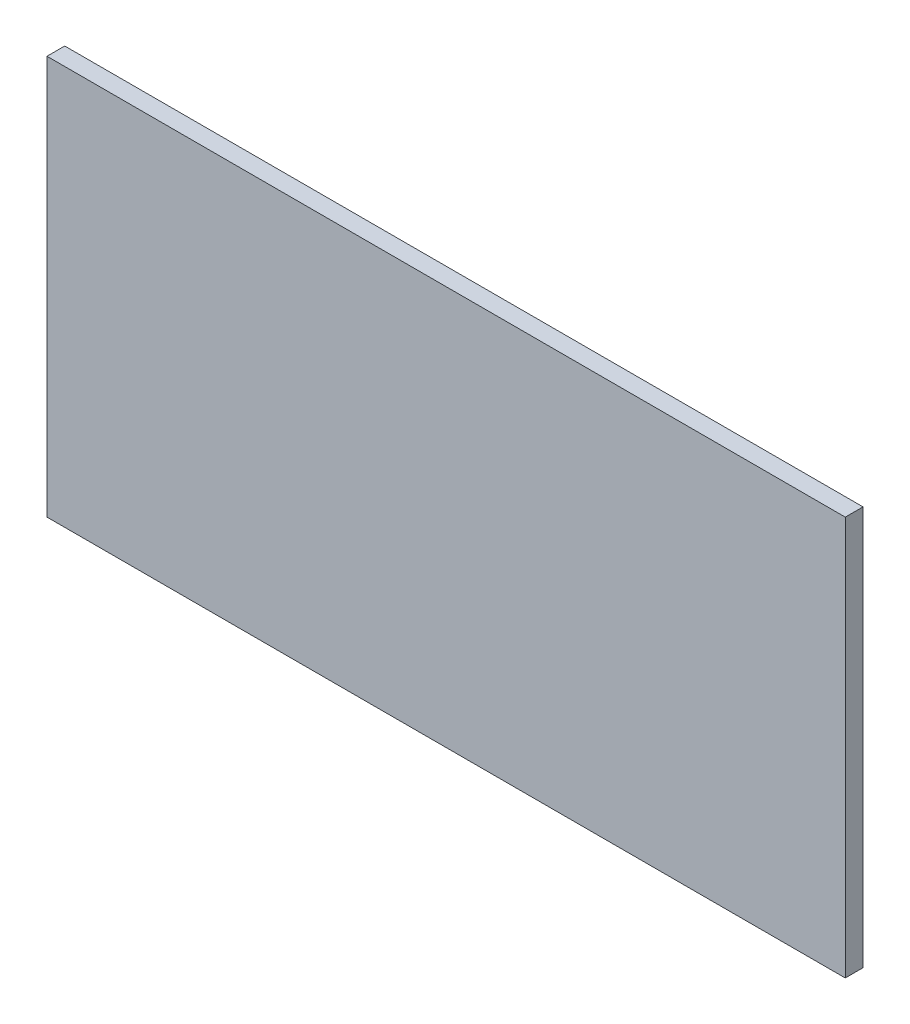
ISO-10303-21;
HEADER;
FILE_DESCRIPTION(('STEP AP214'),'2;1');
FILE_NAME('part.step','',(''),(''),'','','');
FILE_SCHEMA(('AUTOMOTIVE_DESIGN { 1 0 10303 214 1 1 1 1 }'));
ENDSEC;
DATA;
#1=APPLICATION_CONTEXT('core data for automotive mechanical design processes');
#2=APPLICATION_PROTOCOL_DEFINITION('international standard','automotive_design',2000,#1);
#3=PRODUCT_CONTEXT('',#1,'mechanical');
#4=PRODUCT('Part','Part','',(#3));
#5=PRODUCT_RELATED_PRODUCT_CATEGORY('part','',(#4));
#6=PRODUCT_DEFINITION_FORMATION('','',#4);
#7=PRODUCT_DEFINITION_CONTEXT('part definition',#1,'design');
#8=PRODUCT_DEFINITION('design','',#6,#7);
#9=PRODUCT_DEFINITION_SHAPE('','',#8);
#10=(LENGTH_UNIT() NAMED_UNIT(*) SI_UNIT(.MILLI.,.METRE.));
#11=(NAMED_UNIT(*) PLANE_ANGLE_UNIT() SI_UNIT($,.RADIAN.));
#12=(NAMED_UNIT(*) SI_UNIT($,.STERADIAN.) SOLID_ANGLE_UNIT());
#13=UNCERTAINTY_MEASURE_WITH_UNIT(LENGTH_MEASURE(1.E-05),#10,'distance_accuracy_value','');
#14=(GEOMETRIC_REPRESENTATION_CONTEXT(3) GLOBAL_UNCERTAINTY_ASSIGNED_CONTEXT((#13)) GLOBAL_UNIT_ASSIGNED_CONTEXT((#10,
#11,#12)) REPRESENTATION_CONTEXT('',''));
#15=CARTESIAN_POINT('',(0.,0.,0.));
#16=DIRECTION('',(0.,0.,1.));
#17=DIRECTION('',(1.,0.,0.));
#18=AXIS2_PLACEMENT_3D('',#15,#16,#17);
#19=CARTESIAN_POINT('',(-560.259550889472,291.968503937008,20.));
#20=DIRECTION('',(1.,0.,0.));
#21=DIRECTION('',(0.,0.,-1.));
#22=AXIS2_PLACEMENT_3D('',#19,#20,#21);
#23=PLANE('',#22);
#24=DIRECTION('',(0.,-1.,0.));
#25=VECTOR('',#24,1.);
#26=CARTESIAN_POINT('',(-560.259550889472,291.968503937008,0.));
#27=LINE('',#26,#25);
#28=CARTESIAN_POINT('',(-560.259550889472,291.968503937008,0.));
#29=VERTEX_POINT('',#28);
#30=CARTESIAN_POINT('',(-560.259550889472,-158.031496062992,0.));
#31=VERTEX_POINT('',#30);
#32=EDGE_CURVE('E96',#29,#31,#27,.T.);
#33=ORIENTED_EDGE('',*,*,#32,.T.);
#34=DIRECTION('',(0.,0.,-1.));
#35=VECTOR('',#34,1.);
#36=CARTESIAN_POINT('',(-560.259550889472,-158.031496062992,20.));
#37=LINE('',#36,#35);
#38=CARTESIAN_POINT('',(-560.259550889472,-158.031496062992,20.));
#39=VERTEX_POINT('',#38);
#40=EDGE_CURVE('E11',#39,#31,#37,.T.);
#41=ORIENTED_EDGE('',*,*,#40,.F.);
#42=DIRECTION('',(0.,-1.,0.));
#43=VECTOR('',#42,1.);
#44=CARTESIAN_POINT('',(-560.259550889472,291.968503937008,20.));
#45=LINE('',#44,#43);
#46=CARTESIAN_POINT('',(-560.259550889472,291.968503937008,20.));
#47=VERTEX_POINT('',#46);
#48=EDGE_CURVE('E84',#47,#39,#45,.T.);
#49=ORIENTED_EDGE('',*,*,#48,.F.);
#50=DIRECTION('',(0.,0.,-1.));
#51=VECTOR('',#50,1.);
#52=CARTESIAN_POINT('',(-560.259550889472,291.968503937008,20.));
#53=LINE('',#52,#51);
#54=EDGE_CURVE('E92',#47,#29,#53,.T.);
#55=ORIENTED_EDGE('',*,*,#54,.T.);
#56=EDGE_LOOP('',(#33,#41,#49,#55));
#57=FACE_BOUND('',#56,.T.);
#58=ADVANCED_FACE('F33',(#57),#23,.F.);
#59=CARTESIAN_POINT('',(-560.259550889472,-158.031496062992,20.));
#60=DIRECTION('',(0.,1.,0.));
#61=DIRECTION('',(0.,0.,1.));
#62=AXIS2_PLACEMENT_3D('',#59,#60,#61);
#63=PLANE('',#62);
#64=DIRECTION('',(1.,0.,0.));
#65=VECTOR('',#64,1.);
#66=CARTESIAN_POINT('',(-560.259550889472,-158.031496062992,0.));
#67=LINE('',#66,#65);
#68=CARTESIAN_POINT('',(339.740449110528,-158.031496062992,0.));
#69=VERTEX_POINT('',#68);
#70=EDGE_CURVE('E88',#31,#69,#67,.T.);
#71=ORIENTED_EDGE('',*,*,#70,.T.);
#72=DIRECTION('',(0.,0.,-1.));
#73=VECTOR('',#72,1.);
#74=CARTESIAN_POINT('',(339.740449110528,-158.031496062992,20.));
#75=LINE('',#74,#73);
#76=CARTESIAN_POINT('',(339.740449110528,-158.031496062992,20.));
#77=VERTEX_POINT('',#76);
#78=EDGE_CURVE('E41',#77,#69,#75,.T.);
#79=ORIENTED_EDGE('',*,*,#78,.F.);
#80=DIRECTION('',(1.,0.,0.));
#81=VECTOR('',#80,1.);
#82=CARTESIAN_POINT('',(-560.259550889472,-158.031496062992,20.));
#83=LINE('',#82,#81);
#84=EDGE_CURVE('E79',#39,#77,#83,.T.);
#85=ORIENTED_EDGE('',*,*,#84,.F.);
#86=ORIENTED_EDGE('',*,*,#40,.T.);
#87=EDGE_LOOP('',(#71,#79,#85,#86));
#88=FACE_BOUND('',#87,.T.);
#89=ADVANCED_FACE('F87',(#88),#63,.F.);
#90=CARTESIAN_POINT('',(339.740449110528,291.968503937008,20.));
#91=DIRECTION('',(-1.,0.,0.));
#92=DIRECTION('',(0.,-1.,0.));
#93=AXIS2_PLACEMENT_3D('',#90,#91,#92);
#94=PLANE('',#93);
#95=DIRECTION('',(0.,1.,0.));
#96=VECTOR('',#95,1.);
#97=CARTESIAN_POINT('',(339.740449110528,291.968503937008,0.));
#98=LINE('',#97,#96);
#99=CARTESIAN_POINT('',(339.740449110528,291.968503937008,0.));
#100=VERTEX_POINT('',#99);
#101=EDGE_CURVE('E66',#69,#100,#98,.T.);
#102=ORIENTED_EDGE('',*,*,#101,.T.);
#103=DIRECTION('',(0.,0.,-1.));
#104=VECTOR('',#103,1.);
#105=CARTESIAN_POINT('',(339.740449110528,291.968503937008,20.));
#106=LINE('',#105,#104);
#107=CARTESIAN_POINT('',(339.740449110528,291.968503937008,20.));
#108=VERTEX_POINT('',#107);
#109=EDGE_CURVE('E89',#108,#100,#106,.T.);
#110=ORIENTED_EDGE('',*,*,#109,.F.);
#111=DIRECTION('',(0.,1.,0.));
#112=VECTOR('',#111,1.);
#113=CARTESIAN_POINT('',(339.740449110528,291.968503937008,20.));
#114=LINE('',#113,#112);
#115=EDGE_CURVE('E82',#77,#108,#114,.T.);
#116=ORIENTED_EDGE('',*,*,#115,.F.);
#117=ORIENTED_EDGE('',*,*,#78,.T.);
#118=EDGE_LOOP('',(#102,#110,#116,#117));
#119=FACE_BOUND('',#118,.T.);
#120=ADVANCED_FACE('F90',(#119),#94,.F.);
#121=CARTESIAN_POINT('',(-560.259550889472,291.968503937008,20.));
#122=DIRECTION('',(0.,-1.,0.));
#123=DIRECTION('',(0.,0.,-1.));
#124=AXIS2_PLACEMENT_3D('',#121,#122,#123);
#125=PLANE('',#124);
#126=DIRECTION('',(-1.,0.,0.));
#127=VECTOR('',#126,1.);
#128=CARTESIAN_POINT('',(-560.259550889472,291.968503937008,0.));
#129=LINE('',#128,#127);
#130=EDGE_CURVE('E72',#100,#29,#129,.T.);
#131=ORIENTED_EDGE('',*,*,#130,.T.);
#132=ORIENTED_EDGE('',*,*,#54,.F.);
#133=DIRECTION('',(-1.,0.,0.));
#134=VECTOR('',#133,1.);
#135=CARTESIAN_POINT('',(-560.259550889472,291.968503937008,20.));
#136=LINE('',#135,#134);
#137=EDGE_CURVE('E49',#108,#47,#136,.T.);
#138=ORIENTED_EDGE('',*,*,#137,.F.);
#139=ORIENTED_EDGE('',*,*,#109,.T.);
#140=EDGE_LOOP('',(#131,#132,#138,#139));
#141=FACE_BOUND('',#140,.T.);
#142=ADVANCED_FACE('F103',(#141),#125,.F.);
#143=CARTESIAN_POINT('',(0.,0.,20.));
#144=DIRECTION('',(0.,0.,1.));
#145=DIRECTION('',(1.,0.,0.));
#146=AXIS2_PLACEMENT_3D('',#143,#144,#145);
#147=PLANE('',#146);
#148=ORIENTED_EDGE('',*,*,#48,.T.);
#149=ORIENTED_EDGE('',*,*,#84,.T.);
#150=ORIENTED_EDGE('',*,*,#115,.T.);
#151=ORIENTED_EDGE('',*,*,#137,.T.);
#152=EDGE_LOOP('',(#148,#149,#150,#151));
#153=FACE_BOUND('',#152,.T.);
#154=ADVANCED_FACE('F80',(#153),#147,.T.);
#155=CARTESIAN_POINT('',(0.,0.,0.));
#156=DIRECTION('',(0.,0.,1.));
#157=DIRECTION('',(1.,0.,0.));
#158=AXIS2_PLACEMENT_3D('',#155,#156,#157);
#159=PLANE('',#158);
#160=ORIENTED_EDGE('',*,*,#32,.F.);
#161=ORIENTED_EDGE('',*,*,#130,.F.);
#162=ORIENTED_EDGE('',*,*,#101,.F.);
#163=ORIENTED_EDGE('',*,*,#70,.F.);
#164=EDGE_LOOP('',(#160,#161,#162,#163));
#165=FACE_BOUND('',#164,.T.);
#166=ADVANCED_FACE('F106',(#165),#159,.F.);
#167=CLOSED_SHELL('',(#58,#89,#120,#142,#154,#166));
#168=MANIFOLD_SOLID_BREP('B2',#167);
#169=ADVANCED_BREP_SHAPE_REPRESENTATION('',(#18,#168),#14);
#170=SHAPE_DEFINITION_REPRESENTATION(#9,#169);
ENDSEC;
END-ISO-10303-21;
